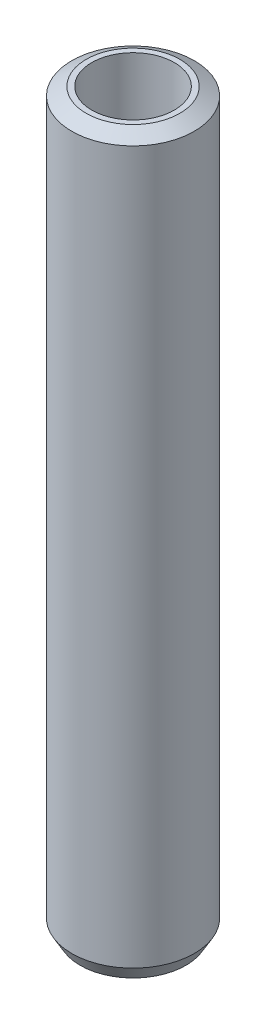
ISO-10303-21;
HEADER;
FILE_DESCRIPTION(('STEP AP214'),'2;1');
FILE_NAME('part.step','',(''),(''),'','','');
FILE_SCHEMA(('AUTOMOTIVE_DESIGN { 1 0 10303 214 1 1 1 1 }'));
ENDSEC;
DATA;
#1=APPLICATION_CONTEXT('core data for automotive mechanical design processes');
#2=APPLICATION_PROTOCOL_DEFINITION('international standard','automotive_design',2000,#1);
#3=PRODUCT_CONTEXT('',#1,'mechanical');
#4=PRODUCT('Part','Part','',(#3));
#5=PRODUCT_RELATED_PRODUCT_CATEGORY('part','',(#4));
#6=PRODUCT_DEFINITION_FORMATION('','',#4);
#7=PRODUCT_DEFINITION_CONTEXT('part definition',#1,'design');
#8=PRODUCT_DEFINITION('design','',#6,#7);
#9=PRODUCT_DEFINITION_SHAPE('','',#8);
#10=(LENGTH_UNIT() NAMED_UNIT(*) SI_UNIT(.MILLI.,.METRE.));
#11=(NAMED_UNIT(*) PLANE_ANGLE_UNIT() SI_UNIT($,.RADIAN.));
#12=(NAMED_UNIT(*) SI_UNIT($,.STERADIAN.) SOLID_ANGLE_UNIT());
#13=UNCERTAINTY_MEASURE_WITH_UNIT(LENGTH_MEASURE(1.E-05),#10,'distance_accuracy_value','');
#14=(GEOMETRIC_REPRESENTATION_CONTEXT(3) GLOBAL_UNCERTAINTY_ASSIGNED_CONTEXT((#13)) GLOBAL_UNIT_ASSIGNED_CONTEXT((#10,
#11,#12)) REPRESENTATION_CONTEXT('',''));
#15=CARTESIAN_POINT('',(0.,0.,0.));
#16=DIRECTION('',(0.,0.,1.));
#17=DIRECTION('',(1.,0.,0.));
#18=AXIS2_PLACEMENT_3D('',#15,#16,#17);
#19=CARTESIAN_POINT('',(0.,149.965844447522,0.));
#20=DIRECTION('',(0.,-1.,0.));
#21=DIRECTION('',(0.,0.,-1.));
#22=AXIS2_PLACEMENT_3D('',#19,#20,#21);
#23=CYLINDRICAL_SURFACE('',#22,12.5);
#24=CARTESIAN_POINT('',(0.,148.264893851443,0.));
#25=DIRECTION('',(0.,1.,0.));
#26=DIRECTION('',(0.,0.,1.));
#27=AXIS2_PLACEMENT_3D('',#24,#25,#26);
#28=CIRCLE('',#27,12.5);
#29=CARTESIAN_POINT('',(0.,148.264893851443,-12.5));
#30=VERTEX_POINT('',#29);
#31=EDGE_CURVE('E50',#30,#30,#28,.F.);
#32=CARTESIAN_POINT('',(0.,2.94613285357415,0.));
#33=DIRECTION('',(0.,1.,0.));
#34=DIRECTION('',(0.,0.,1.));
#35=AXIS2_PLACEMENT_3D('',#32,#33,#34);
#36=CIRCLE('',#35,12.5);
#37=CARTESIAN_POINT('',(0.,2.94613285357415,-12.5));
#38=VERTEX_POINT('',#37);
#39=EDGE_CURVE('E51',#38,#38,#36,.T.);
#40=CARTESIAN_POINT('',(0.,148.264893851443,-12.5));
#41=CARTESIAN_POINT('',(0.,146.751156757715,-12.5));
#42=CARTESIAN_POINT('',(0.,145.237419663987,-12.5));
#43=CARTESIAN_POINT('',(0.,142.209945476531,-12.5));
#44=CARTESIAN_POINT('',(0.,140.696208382804,-12.5));
#45=CARTESIAN_POINT('',(0.,137.668734195348,-12.5));
#46=CARTESIAN_POINT('',(0.,136.15499710162,-12.5));
#47=CARTESIAN_POINT('',(0.,133.127522914165,-12.5));
#48=CARTESIAN_POINT('',(0.,131.613785820437,-12.5));
#49=CARTESIAN_POINT('',(0.,128.586311632981,-12.5));
#50=CARTESIAN_POINT('',(0.,127.072574539253,-12.5));
#51=CARTESIAN_POINT('',(0.,124.045100351798,-12.5));
#52=CARTESIAN_POINT('',(0.,122.53136325807,-12.5));
#53=CARTESIAN_POINT('',(0.,119.503889070614,-12.5));
#54=CARTESIAN_POINT('',(0.,117.990151976887,-12.5));
#55=CARTESIAN_POINT('',(0.,114.962677789431,-12.5));
#56=CARTESIAN_POINT('',(0.,113.448940695703,-12.5));
#57=CARTESIAN_POINT('',(0.,110.421466508248,-12.5));
#58=CARTESIAN_POINT('',(0.,108.90772941452,-12.5));
#59=CARTESIAN_POINT('',(0.,105.880255227064,-12.5));
#60=CARTESIAN_POINT('',(0.,104.366518133336,-12.5));
#61=CARTESIAN_POINT('',(0.,101.339043945881,-12.5));
#62=CARTESIAN_POINT('',(0.,99.8253068521531,-12.5));
#63=CARTESIAN_POINT('',(0.,96.7978326646975,-12.5));
#64=CARTESIAN_POINT('',(0.,95.2840955709697,-12.5));
#65=CARTESIAN_POINT('',(0.,92.2566213835141,-12.5));
#66=CARTESIAN_POINT('',(0.,90.7428842897863,-12.5));
#67=CARTESIAN_POINT('',(0.,87.7154101023307,-12.5));
#68=CARTESIAN_POINT('',(0.,86.2016730086029,-12.5));
#69=CARTESIAN_POINT('',(0.,83.1741988211473,-12.5));
#70=CARTESIAN_POINT('',(0.,81.6604617274195,-12.5));
#71=CARTESIAN_POINT('',(0.,78.6329875399639,-12.5));
#72=CARTESIAN_POINT('',(0.,77.1192504462362,-12.5));
#73=CARTESIAN_POINT('',(0.,74.0917762587806,-12.5));
#74=CARTESIAN_POINT('',(0.,72.5780391650528,-12.5));
#75=CARTESIAN_POINT('',(0.,69.5505649775972,-12.5));
#76=CARTESIAN_POINT('',(0.,68.0368278838694,-12.5));
#77=CARTESIAN_POINT('',(0.,65.0093536964138,-12.5));
#78=CARTESIAN_POINT('',(0.,63.495616602686,-12.5));
#79=CARTESIAN_POINT('',(0.,60.4681424152304,-12.5));
#80=CARTESIAN_POINT('',(0.,58.9544053215026,-12.5));
#81=CARTESIAN_POINT('',(0.,55.926931134047,-12.5));
#82=CARTESIAN_POINT('',(0.,54.4131940403192,-12.5));
#83=CARTESIAN_POINT('',(0.,51.3857198528636,-12.5));
#84=CARTESIAN_POINT('',(0.,49.8719827591358,-12.5));
#85=CARTESIAN_POINT('',(0.,46.8445085716802,-12.5));
#86=CARTESIAN_POINT('',(0.,45.3307714779524,-12.5));
#87=CARTESIAN_POINT('',(0.,42.3032972904968,-12.5));
#88=CARTESIAN_POINT('',(0.,40.7895601967691,-12.5));
#89=CARTESIAN_POINT('',(0.,37.7620860093135,-12.5));
#90=CARTESIAN_POINT('',(0.,36.2483489155857,-12.5));
#91=CARTESIAN_POINT('',(0.,33.2208747281301,-12.5));
#92=CARTESIAN_POINT('',(0.,31.7071376344023,-12.5));
#93=CARTESIAN_POINT('',(0.,28.6796634469467,-12.5));
#94=CARTESIAN_POINT('',(0.,27.1659263532189,-12.5));
#95=CARTESIAN_POINT('',(0.,24.1384521657633,-12.5));
#96=CARTESIAN_POINT('',(0.,22.6247150720355,-12.5));
#97=CARTESIAN_POINT('',(0.,19.5972408845799,-12.5));
#98=CARTESIAN_POINT('',(0.,18.0835037908521,-12.5));
#99=CARTESIAN_POINT('',(0.,15.0560296033965,-12.5));
#100=CARTESIAN_POINT('',(0.,13.5422925096687,-12.5));
#101=CARTESIAN_POINT('',(0.,10.5148183222131,-12.5));
#102=CARTESIAN_POINT('',(0.,9.00108122848535,-12.5));
#103=CARTESIAN_POINT('',(0.,5.97360704102975,-12.5));
#104=CARTESIAN_POINT('',(0.,4.45986994730195,-12.5));
#105=CARTESIAN_POINT('',(0.,2.94613285357415,-12.5));
#106=B_SPLINE_CURVE_WITH_KNOTS('',3,(#40,#41,#42,#43,#44,#45,#46,#47,#48,#49,#50,#51,#52,#53,
#54,#55,#56,#57,#58,#59,#60,#61,#62,#63,#64,#65,#66,#67,#68,#69,#70,#71,#72,#73,#74,#75,#76,#77,
#78,#79,#80,#81,#82,#83,#84,#85,#86,#87,#88,#89,#90,#91,#92,#93,#94,#95,#96,#97,#98,#99,#100,
#101,#102,#103,#104,#105),.UNSPECIFIED.,.F.,.F.,(4,2,2,2,2,2,2,2,2,2,2,2,2,2,2,2,2,2,2,2,2,2,2,
2,2,2,2,2,2,2,2,2,4),(0.,4.54121128118337,9.08242256236677,13.6236338435501,18.1648451247335,
22.7060564059169,27.2472676871003,31.7884789682837,36.3296902494671,40.8709015306505,
45.4121128118339,49.9533240930173,54.4945353742006,59.035746655384,63.5769579365674,
68.1181692177508,72.6593804989342,77.2005917801176,81.741803061301,86.2830143424843,
90.8242256236677,95.3654369048511,99.9066481860345,104.447859467218,108.989070748401,
113.530282029585,118.071493310768,122.612704591951,127.153915873135,131.695127154318,
136.236338435502,140.777549716685,145.318760997868),.UNSPECIFIED.);
#107=EDGE_CURVE('BSEAM39',#30,#38,#106,.T.);
#108=ORIENTED_EDGE('',*,*,#31,.T.);
#109=ORIENTED_EDGE('',*,*,#39,.T.);
#110=ORIENTED_EDGE('',*,*,#107,.T.);
#111=ORIENTED_EDGE('',*,*,#107,.F.);
#112=EDGE_LOOP('',(#108,#110,#109,#111));
#113=FACE_BOUND('',#112,.T.);
#114=ADVANCED_FACE('F39',(#113),#23,.T.);
#115=CARTESIAN_POINT('',(0.,149.965844447522,0.));
#116=DIRECTION('',(0.,1.,0.));
#117=DIRECTION('',(0.,0.,1.));
#118=AXIS2_PLACEMENT_3D('',#115,#116,#117);
#119=PLANE('',#118);
#120=CARTESIAN_POINT('',(0.,149.965844447522,0.));
#121=DIRECTION('',(0.,1.,0.));
#122=DIRECTION('',(0.,0.,1.));
#123=AXIS2_PLACEMENT_3D('',#120,#121,#122);
#124=CIRCLE('',#123,9.55386714642598);
#125=CARTESIAN_POINT('',(0.,149.965844447522,-9.553867146426));
#126=VERTEX_POINT('',#125);
#127=EDGE_CURVE('E54',#126,#126,#124,.T.);
#128=ORIENTED_EDGE('',*,*,#127,.T.);
#129=EDGE_LOOP('',(#128));
#130=FACE_BOUND('',#129,.T.);
#131=CARTESIAN_POINT('',(0.,149.965844447522,0.));
#132=DIRECTION('',(0.,1.,0.));
#133=DIRECTION('',(0.,0.,1.));
#134=AXIS2_PLACEMENT_3D('',#131,#132,#133);
#135=CIRCLE('',#134,8.42113263981361);
#136=CARTESIAN_POINT('',(0.,149.965844447522,8.42113263981361));
#137=VERTEX_POINT('',#136);
#138=EDGE_CURVE('E58',#137,#137,#135,.T.);
#139=ORIENTED_EDGE('',*,*,#138,.F.);
#140=EDGE_LOOP('',(#139));
#141=FACE_BOUND('',#140,.T.);
#142=ADVANCED_FACE('F69',(#130,#141),#119,.T.);
#143=CARTESIAN_POINT('',(0.,0.,0.));
#144=DIRECTION('',(0.,1.,0.));
#145=DIRECTION('',(0.,0.,1.));
#146=AXIS2_PLACEMENT_3D('',#143,#144,#145);
#147=PLANE('',#146);
#148=CARTESIAN_POINT('',(0.,0.,0.));
#149=DIRECTION('',(0.,1.,0.));
#150=DIRECTION('',(0.,0.,1.));
#151=AXIS2_PLACEMENT_3D('',#148,#149,#150);
#152=CIRCLE('',#151,10.7990494039206);
#153=CARTESIAN_POINT('',(0.,0.,10.7990494039206));
#154=VERTEX_POINT('',#153);
#155=EDGE_CURVE('E10',#154,#154,#152,.F.);
#156=ORIENTED_EDGE('',*,*,#155,.T.);
#157=EDGE_LOOP('',(#156));
#158=FACE_BOUND('',#157,.T.);
#159=CARTESIAN_POINT('',(0.,0.,0.));
#160=DIRECTION('',(0.,1.,0.));
#161=DIRECTION('',(0.,0.,1.));
#162=AXIS2_PLACEMENT_3D('',#159,#160,#161);
#163=CIRCLE('',#162,8.42113263981361);
#164=CARTESIAN_POINT('',(0.,0.,8.42113263981361));
#165=VERTEX_POINT('',#164);
#166=EDGE_CURVE('E63',#165,#165,#163,.T.);
#167=ORIENTED_EDGE('',*,*,#166,.T.);
#168=EDGE_LOOP('',(#167));
#169=FACE_BOUND('',#168,.T.);
#170=ADVANCED_FACE('F75',(#158,#169),#147,.F.);
#171=CARTESIAN_POINT('',(0.,149.965844447522,0.));
#172=DIRECTION('',(0.,-1.,0.));
#173=DIRECTION('',(0.,0.,-1.));
#174=AXIS2_PLACEMENT_3D('',#171,#172,#173);
#175=CYLINDRICAL_SURFACE('',#174,8.42113263981361);
#176=ORIENTED_EDGE('',*,*,#138,.T.);
#177=EDGE_LOOP('',(#176));
#178=FACE_BOUND('',#177,.T.);
#179=ORIENTED_EDGE('',*,*,#166,.F.);
#180=EDGE_LOOP('',(#179));
#181=FACE_BOUND('',#180,.T.);
#182=ADVANCED_FACE('F70',(#178,#181),#175,.F.);
#183=CARTESIAN_POINT('',(0.,149.965844447522,0.));
#184=DIRECTION('',(0.,-1.,0.));
#185=DIRECTION('',(0.,0.,-1.));
#186=AXIS2_PLACEMENT_3D('',#183,#184,#185);
#187=CONICAL_SURFACE('',#186,9.55386714642598,1.0471975511966);
#188=CARTESIAN_POINT('',(0.,148.264893851443,-12.5));
#189=CARTESIAN_POINT('',(0.,148.282612086818,-12.4693111161086));
#190=CARTESIAN_POINT('',(0.,148.300330322194,-12.4386222322172));
#191=CARTESIAN_POINT('',(0.,148.335766792946,-12.3772444644344));
#192=CARTESIAN_POINT('',(0.,148.353485028322,-12.346555580543));
#193=CARTESIAN_POINT('',(0.,148.388921499073,-12.2851778127603));
#194=CARTESIAN_POINT('',(0.,148.406639734449,-12.2544889288689));
#195=CARTESIAN_POINT('',(0.,148.442076205201,-12.1931111610861));
#196=CARTESIAN_POINT('',(0.,148.459794440577,-12.1624222771947));
#197=CARTESIAN_POINT('',(0.,148.495230911328,-12.1010445094119));
#198=CARTESIAN_POINT('',(0.,148.512949146704,-12.0703556255205));
#199=CARTESIAN_POINT('',(0.,148.548385617456,-12.0089778577377));
#200=CARTESIAN_POINT('',(0.,148.566103852832,-11.9782889738463));
#201=CARTESIAN_POINT('',(0.,148.601540323583,-11.9169112060635));
#202=CARTESIAN_POINT('',(0.,148.619258558959,-11.8862223221721));
#203=CARTESIAN_POINT('',(0.,148.654695029711,-11.8248445543893));
#204=CARTESIAN_POINT('',(0.,148.672413265087,-11.7941556704979));
#205=CARTESIAN_POINT('',(0.,148.707849735838,-11.7327779027151));
#206=CARTESIAN_POINT('',(0.,148.725567971214,-11.7020890188237));
#207=CARTESIAN_POINT('',(0.,148.761004441966,-11.6407112510409));
#208=CARTESIAN_POINT('',(0.,148.778722677342,-11.6100223671495));
#209=CARTESIAN_POINT('',(0.,148.814159148093,-11.5486445993667));
#210=CARTESIAN_POINT('',(0.,148.831877383469,-11.5179557154754));
#211=CARTESIAN_POINT('',(0.,148.867313854221,-11.4565779476926));
#212=CARTESIAN_POINT('',(0.,148.885032089596,-11.4258890638012));
#213=CARTESIAN_POINT('',(0.,148.920468560348,-11.3645112960184));
#214=CARTESIAN_POINT('',(0.,148.938186795724,-11.333822412127));
#215=CARTESIAN_POINT('',(0.,148.973623266476,-11.2724446443442));
#216=CARTESIAN_POINT('',(0.,148.991341501851,-11.2417557604528));
#217=CARTESIAN_POINT('',(0.,149.026777972603,-11.18037799267));
#218=CARTESIAN_POINT('',(0.,149.044496207979,-11.1496891087786));
#219=CARTESIAN_POINT('',(0.,149.079932678731,-11.0883113409958));
#220=CARTESIAN_POINT('',(0.,149.097650914106,-11.0576224571044));
#221=CARTESIAN_POINT('',(0.,149.133087384858,-10.9962446893216));
#222=CARTESIAN_POINT('',(0.,149.150805620234,-10.9655558054302));
#223=CARTESIAN_POINT('',(0.,149.186242090986,-10.9041780376474));
#224=CARTESIAN_POINT('',(0.,149.203960326361,-10.873489153756));
#225=CARTESIAN_POINT('',(0.,149.239396797113,-10.8121113859732));
#226=CARTESIAN_POINT('',(0.,149.257115032489,-10.7814225020818));
#227=CARTESIAN_POINT('',(0.,149.292551503241,-10.7200447342991));
#228=CARTESIAN_POINT('',(0.,149.310269738616,-10.6893558504077));
#229=CARTESIAN_POINT('',(0.,149.345706209368,-10.6279780826249));
#230=CARTESIAN_POINT('',(0.,149.363424444744,-10.5972891987335));
#231=CARTESIAN_POINT('',(0.,149.398860915495,-10.5359114309507));
#232=CARTESIAN_POINT('',(0.,149.416579150871,-10.5052225470593));
#233=CARTESIAN_POINT('',(0.,149.452015621623,-10.4438447792765));
#234=CARTESIAN_POINT('',(0.,149.469733856999,-10.4131558953851));
#235=CARTESIAN_POINT('',(0.,149.50517032775,-10.3517781276023));
#236=CARTESIAN_POINT('',(0.,149.522888563126,-10.3210892437109));
#237=CARTESIAN_POINT('',(0.,149.558325033878,-10.2597114759281));
#238=CARTESIAN_POINT('',(0.,149.576043269254,-10.2290225920367));
#239=CARTESIAN_POINT('',(0.,149.611479740005,-10.1676448242539));
#240=CARTESIAN_POINT('',(0.,149.629197975381,-10.1369559403625));
#241=CARTESIAN_POINT('',(0.,149.664634446133,-10.0755781725797));
#242=CARTESIAN_POINT('',(0.,149.682352681509,-10.0448892886883));
#243=CARTESIAN_POINT('',(0.,149.71778915226,-9.98351152090554));
#244=CARTESIAN_POINT('',(0.,149.735507387636,-9.95282263701415));
#245=CARTESIAN_POINT('',(0.,149.770943858388,-9.89144486923136));
#246=CARTESIAN_POINT('',(0.,149.788662093764,-9.86075598533996));
#247=CARTESIAN_POINT('',(0.,149.824098564515,-9.79937821755717));
#248=CARTESIAN_POINT('',(0.,149.841816799891,-9.76868933366577));
#249=CARTESIAN_POINT('',(0.,149.877253270643,-9.70731156588298));
#250=CARTESIAN_POINT('',(0.,149.894971506019,-9.67662268199158));
#251=CARTESIAN_POINT('',(0.,149.93040797677,-9.61524491420879));
#252=CARTESIAN_POINT('',(0.,149.948126212146,-9.5845560303174));
#253=CARTESIAN_POINT('',(0.,149.965844447522,-9.553867146426));
#254=B_SPLINE_CURVE_WITH_KNOTS('',3,(#188,#189,#190,#191,#192,#193,#194,#195,#196,#197,#198,
#199,#200,#201,#202,#203,#204,#205,#206,#207,#208,#209,#210,#211,#212,#213,#214,#215,#216,#217,
#218,#219,#220,#221,#222,#223,#224,#225,#226,#227,#228,#229,#230,#231,#232,#233,#234,#235,#236,
#237,#238,#239,#240,#241,#242,#243,#244,#245,#246,#247,#248,#249,#250,#251,#252,#253),
.UNSPECIFIED.,.F.,.F.,(4,2,2,2,2,2,2,2,2,2,2,2,2,2,2,2,2,2,2,2,2,2,2,2,2,2,2,2,2,2,2,2,4),(0.,
0.106309412254951,0.212618824509917,0.318928236764868,0.425237649019832,0.531547061274797,
0.637856473529748,0.744165885784713,0.850475298039677,0.956784710294628,1.06309412254959,
1.16940353480456,1.27571294705951,1.38202235931447,1.48833177156944,1.59464118382439,
1.70095059607935,1.80726000833432,1.91356942058927,2.01987883284424,2.1261882450992,
2.23249765735415,2.33880706960912,2.44511648186408,2.55142589411903,2.657735306374,
2.76404471862896,2.87035413088391,2.97666354313888,3.08297295539384,3.18928236764879,
3.29559177990376,3.40190119215872),.UNSPECIFIED.);
#255=EDGE_CURVE('BSEAM81',#30,#126,#254,.T.);
#256=ORIENTED_EDGE('',*,*,#31,.F.);
#257=ORIENTED_EDGE('',*,*,#127,.F.);
#258=ORIENTED_EDGE('',*,*,#255,.T.);
#259=ORIENTED_EDGE('',*,*,#255,.F.);
#260=EDGE_LOOP('',(#256,#258,#257,#259));
#261=FACE_BOUND('',#260,.T.);
#262=ADVANCED_FACE('F81',(#261),#187,.T.);
#263=CARTESIAN_POINT('',(0.,2.94613285357415,0.));
#264=DIRECTION('',(0.,1.,0.));
#265=DIRECTION('',(0.,0.,1.));
#266=AXIS2_PLACEMENT_3D('',#263,#264,#265);
#267=CONICAL_SURFACE('',#266,12.5,0.523598775598302);
#268=ORIENTED_EDGE('',*,*,#155,.F.);
#269=EDGE_LOOP('',(#268));
#270=FACE_BOUND('',#269,.T.);
#271=ORIENTED_EDGE('',*,*,#39,.F.);
#272=EDGE_LOOP('',(#271));
#273=FACE_BOUND('',#272,.T.);
#274=ADVANCED_FACE('F45',(#270,#273),#267,.T.);
#275=CLOSED_SHELL('',(#114,#142,#170,#182,#262,#274));
#276=MANIFOLD_SOLID_BREP('B2',#275);
#277=ADVANCED_BREP_SHAPE_REPRESENTATION('',(#18,#276),#14);
#278=SHAPE_DEFINITION_REPRESENTATION(#9,#277);
ENDSEC;
END-ISO-10303-21;
